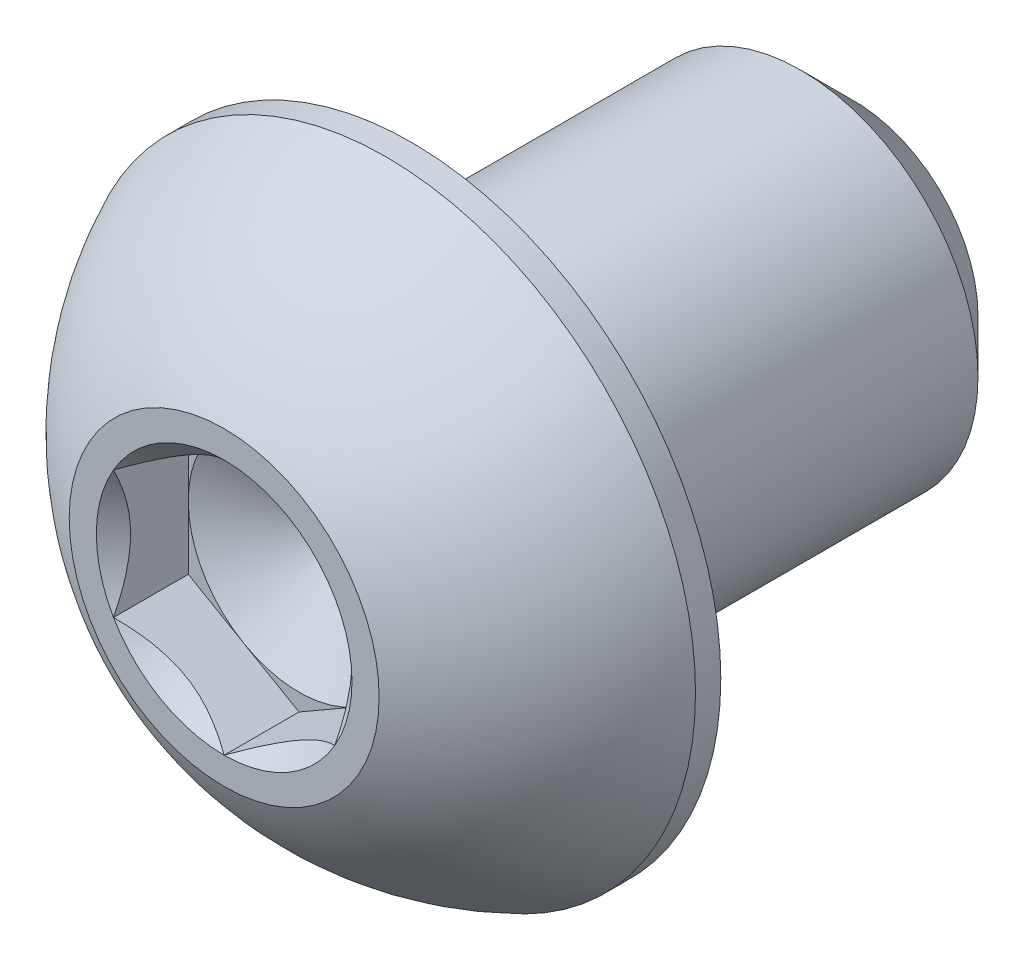
ISO-10303-21;
HEADER;
FILE_DESCRIPTION(('STEP AP214'),'2;1');
FILE_NAME('part.step','',(''),(''),'','','');
FILE_SCHEMA(('AUTOMOTIVE_DESIGN { 1 0 10303 214 1 1 1 1 }'));
ENDSEC;
DATA;
#1=APPLICATION_CONTEXT('core data for automotive mechanical design processes');
#2=APPLICATION_PROTOCOL_DEFINITION('international standard','automotive_design',2000,#1);
#3=PRODUCT_CONTEXT('',#1,'mechanical');
#4=PRODUCT('Part','Part','',(#3));
#5=PRODUCT_RELATED_PRODUCT_CATEGORY('part','',(#4));
#6=PRODUCT_DEFINITION_FORMATION('','',#4);
#7=PRODUCT_DEFINITION_CONTEXT('part definition',#1,'design');
#8=PRODUCT_DEFINITION('design','',#6,#7);
#9=PRODUCT_DEFINITION_SHAPE('','',#8);
#10=(LENGTH_UNIT() NAMED_UNIT(*) SI_UNIT(.MILLI.,.METRE.));
#11=(NAMED_UNIT(*) PLANE_ANGLE_UNIT() SI_UNIT($,.RADIAN.));
#12=(NAMED_UNIT(*) SI_UNIT($,.STERADIAN.) SOLID_ANGLE_UNIT());
#13=UNCERTAINTY_MEASURE_WITH_UNIT(LENGTH_MEASURE(1.E-05),#10,'distance_accuracy_value','');
#14=(GEOMETRIC_REPRESENTATION_CONTEXT(3) GLOBAL_UNCERTAINTY_ASSIGNED_CONTEXT((#13)) GLOBAL_UNIT_ASSIGNED_CONTEXT((#10,
#11,#12)) REPRESENTATION_CONTEXT('',''));
#15=CARTESIAN_POINT('',(0.,0.,0.));
#16=DIRECTION('',(0.,0.,1.));
#17=DIRECTION('',(1.,0.,0.));
#18=AXIS2_PLACEMENT_3D('',#15,#16,#17);
#19=CARTESIAN_POINT('',(0.,1.984375,5.64515));
#20=DIRECTION('',(0.,0.,-1.));
#21=DIRECTION('',(-1.,0.,0.));
#22=AXIS2_PLACEMENT_3D('',#19,#20,#21);
#23=PLANE('',#22);
#24=CARTESIAN_POINT('',(0.,0.,5.64515));
#25=DIRECTION('',(0.,0.,1.));
#26=DIRECTION('',(1.,0.,0.));
#27=AXIS2_PLACEMENT_3D('',#24,#25,#26);
#28=CIRCLE('',#27,2.778125);
#29=CARTESIAN_POINT('',(0.,2.778125,5.64515));
#30=VERTEX_POINT('',#29);
#31=EDGE_CURVE('E187',#30,#30,#28,.T.);
#32=ORIENTED_EDGE('',*,*,#31,.T.);
#33=EDGE_LOOP('',(#32));
#34=FACE_BOUND('',#33,.T.);
#35=CARTESIAN_POINT('',(0.,0.,5.64515));
#36=DIRECTION('',(0.,0.,1.));
#37=DIRECTION('',(1.,0.,0.));
#38=AXIS2_PLACEMENT_3D('',#35,#36,#37);
#39=CIRCLE('',#38,2.29135888084633);
#40=CARTESIAN_POINT('',(0.,2.29135888084633,5.64515));
#41=VERTEX_POINT('',#40);
#42=CARTESIAN_POINT('',(-1.984375,1.14567944042316,5.64515));
#43=VERTEX_POINT('',#42);
#44=EDGE_CURVE('E129',#41,#43,#39,.T.);
#45=ORIENTED_EDGE('',*,*,#44,.F.);
#46=CARTESIAN_POINT('',(0.,0.,5.64515));
#47=DIRECTION('',(0.,0.,1.));
#48=DIRECTION('',(1.,0.,0.));
#49=AXIS2_PLACEMENT_3D('',#46,#47,#48);
#50=CIRCLE('',#49,2.29135888084633);
#51=CARTESIAN_POINT('',(1.984375,1.14567944042316,5.64515));
#52=VERTEX_POINT('',#51);
#53=EDGE_CURVE('E113',#52,#41,#50,.T.);
#54=ORIENTED_EDGE('',*,*,#53,.F.);
#55=CARTESIAN_POINT('',(0.,0.,5.64515));
#56=DIRECTION('',(0.,0.,1.));
#57=DIRECTION('',(1.,0.,0.));
#58=AXIS2_PLACEMENT_3D('',#55,#56,#57);
#59=CIRCLE('',#58,2.29135888084633);
#60=CARTESIAN_POINT('',(1.984375,-1.14567944042316,5.64515));
#61=VERTEX_POINT('',#60);
#62=EDGE_CURVE('E125',#61,#52,#59,.T.);
#63=ORIENTED_EDGE('',*,*,#62,.F.);
#64=CARTESIAN_POINT('',(0.,0.,5.64515));
#65=DIRECTION('',(0.,0.,1.));
#66=DIRECTION('',(1.,0.,0.));
#67=AXIS2_PLACEMENT_3D('',#64,#65,#66);
#68=CIRCLE('',#67,2.29135888084633);
#69=CARTESIAN_POINT('',(0.,-2.29135888084633,5.64515));
#70=VERTEX_POINT('',#69);
#71=EDGE_CURVE('E149',#70,#61,#68,.T.);
#72=ORIENTED_EDGE('',*,*,#71,.F.);
#73=CARTESIAN_POINT('',(0.,0.,5.64515));
#74=DIRECTION('',(0.,0.,1.));
#75=DIRECTION('',(1.,0.,0.));
#76=AXIS2_PLACEMENT_3D('',#73,#74,#75);
#77=CIRCLE('',#76,2.29135888084633);
#78=CARTESIAN_POINT('',(-1.984375,-1.14567944042317,5.64515));
#79=VERTEX_POINT('',#78);
#80=EDGE_CURVE('E463',#79,#70,#77,.T.);
#81=ORIENTED_EDGE('',*,*,#80,.F.);
#82=CARTESIAN_POINT('',(0.,0.,5.64515));
#83=DIRECTION('',(0.,0.,1.));
#84=DIRECTION('',(1.,0.,0.));
#85=AXIS2_PLACEMENT_3D('',#82,#83,#84);
#86=CIRCLE('',#85,2.29135888084633);
#87=EDGE_CURVE('E474',#43,#79,#86,.T.);
#88=ORIENTED_EDGE('',*,*,#87,.F.);
#89=EDGE_LOOP('',(#45,#54,#63,#72,#81,#88));
#90=FACE_BOUND('',#89,.T.);
#91=ADVANCED_FACE('F39',(#34,#90),#23,.F.);
#92=CARTESIAN_POINT('',(0.,0.,-5.64515));
#93=DIRECTION('',(0.,0.,1.));
#94=DIRECTION('',(1.,0.,0.));
#95=AXIS2_PLACEMENT_3D('',#92,#93,#94);
#96=CONICAL_SURFACE('',#95,2.2225,0.785398163397448);
#97=CARTESIAN_POINT('',(0.,0.,-4.69265));
#98=DIRECTION('',(0.,0.,1.));
#99=DIRECTION('',(1.,0.,0.));
#100=AXIS2_PLACEMENT_3D('',#97,#98,#99);
#101=CIRCLE('',#100,3.175);
#102=CARTESIAN_POINT('',(3.175,0.,-4.69265));
#103=VERTEX_POINT('',#102);
#104=EDGE_CURVE('E11',#103,#103,#101,.T.);
#105=ORIENTED_EDGE('',*,*,#104,.F.);
#106=EDGE_LOOP('',(#105));
#107=FACE_BOUND('',#106,.T.);
#108=CARTESIAN_POINT('',(0.,0.,-5.64515));
#109=DIRECTION('',(0.,0.,1.));
#110=DIRECTION('',(1.,0.,0.));
#111=AXIS2_PLACEMENT_3D('',#108,#109,#110);
#112=CIRCLE('',#111,2.2225);
#113=CARTESIAN_POINT('',(2.2225,0.,-5.64515));
#114=VERTEX_POINT('',#113);
#115=EDGE_CURVE('E178',#114,#114,#112,.T.);
#116=ORIENTED_EDGE('',*,*,#115,.T.);
#117=EDGE_LOOP('',(#116));
#118=FACE_BOUND('',#117,.T.);
#119=ADVANCED_FACE('F41',(#107,#118),#96,.T.);
#120=CARTESIAN_POINT('',(0.,0.,5.64515));
#121=DIRECTION('',(0.,0.,1.));
#122=DIRECTION('',(1.,0.,0.));
#123=AXIS2_PLACEMENT_3D('',#120,#121,#122);
#124=CYLINDRICAL_SURFACE('',#123,3.175);
#125=CARTESIAN_POINT('',(0.,0.,2.29235));
#126=DIRECTION('',(0.,0.,1.));
#127=DIRECTION('',(1.,0.,0.));
#128=AXIS2_PLACEMENT_3D('',#125,#126,#127);
#129=CIRCLE('',#128,3.175);
#130=CARTESIAN_POINT('',(3.175,0.,2.29235));
#131=VERTEX_POINT('',#130);
#132=EDGE_CURVE('E48',#131,#131,#129,.T.);
#133=ORIENTED_EDGE('',*,*,#132,.F.);
#134=EDGE_LOOP('',(#133));
#135=FACE_BOUND('',#134,.T.);
#136=ORIENTED_EDGE('',*,*,#104,.T.);
#137=EDGE_LOOP('',(#136));
#138=FACE_BOUND('',#137,.T.);
#139=ADVANCED_FACE('F205',(#135,#138),#124,.T.);
#140=CARTESIAN_POINT('',(0.,5.5499,2.29235));
#141=DIRECTION('',(0.,0.,1.));
#142=DIRECTION('',(1.,0.,0.));
#143=AXIS2_PLACEMENT_3D('',#140,#141,#142);
#144=PLANE('',#143);
#145=CARTESIAN_POINT('',(0.,0.,2.29235));
#146=DIRECTION('',(0.,0.,1.));
#147=DIRECTION('',(1.,0.,0.));
#148=AXIS2_PLACEMENT_3D('',#145,#146,#147);
#149=CIRCLE('',#148,5.5499);
#150=CARTESIAN_POINT('',(5.5499,0.,2.29235));
#151=VERTEX_POINT('',#150);
#152=EDGE_CURVE('E196',#151,#151,#149,.T.);
#153=ORIENTED_EDGE('',*,*,#152,.F.);
#154=EDGE_LOOP('',(#153));
#155=FACE_BOUND('',#154,.T.);
#156=ORIENTED_EDGE('',*,*,#132,.T.);
#157=EDGE_LOOP('',(#156));
#158=FACE_BOUND('',#157,.T.);
#159=ADVANCED_FACE('F203',(#155,#158),#144,.F.);
#160=CARTESIAN_POINT('',(0.,0.,5.64515));
#161=DIRECTION('',(0.,0.,1.));
#162=DIRECTION('',(1.,0.,0.));
#163=AXIS2_PLACEMENT_3D('',#160,#161,#162);
#164=CYLINDRICAL_SURFACE('',#163,5.5499);
#165=CARTESIAN_POINT('',(0.,0.,2.74592142857143));
#166=DIRECTION('',(0.,0.,1.));
#167=DIRECTION('',(1.,0.,0.));
#168=AXIS2_PLACEMENT_3D('',#165,#166,#167);
#169=CIRCLE('',#168,5.5499);
#170=CARTESIAN_POINT('',(0.,5.5499,2.74592142857143));
#171=VERTEX_POINT('',#170);
#172=EDGE_CURVE('E192',#171,#171,#169,.T.);
#173=ORIENTED_EDGE('',*,*,#172,.F.);
#174=EDGE_LOOP('',(#173));
#175=FACE_BOUND('',#174,.T.);
#176=ORIENTED_EDGE('',*,*,#152,.T.);
#177=EDGE_LOOP('',(#176));
#178=FACE_BOUND('',#177,.T.);
#179=ADVANCED_FACE('F224',(#175,#178),#164,.T.);
#180=CARTESIAN_POINT('',(0.,0.,0.214578206854551));
#181=DIRECTION('',(0.,0.,1.));
#182=DIRECTION('',(0.,1.,0.));
#183=AXIS2_PLACEMENT_3D('',#180,#181,#182);
#184=SPHERICAL_SURFACE('',#183,6.09992528775);
#185=CARTESIAN_POINT('',(0.,2.778125,5.64515));
#186=CARTESIAN_POINT('',(0.,2.81602671338563,5.62576064772217));
#187=CARTESIAN_POINT('',(0.,2.85372537445918,5.60597438218914));
#188=CARTESIAN_POINT('',(0.,2.92870021164798,5.5656169699155));
#189=CARTESIAN_POINT('',(0.,2.96597638776324,5.54504582317489));
#190=CARTESIAN_POINT('',(0.,3.04008987470138,5.5031275937889));
#191=CARTESIAN_POINT('',(0.,3.07692718552426,5.48178051114351));
#192=CARTESIAN_POINT('',(0.,3.15014680356086,5.43831978760222));
#193=CARTESIAN_POINT('',(0.,3.18652911077458,5.41620614670631));
#194=CARTESIAN_POINT('',(0.,3.25882276944387,5.37122199565968));
#195=CARTESIAN_POINT('',(0.,3.29473412089944,5.34835148550897));
#196=CARTESIAN_POINT('',(0.,3.36607012592493,5.30186362336544));
#197=CARTESIAN_POINT('',(0.,3.40149477949484,5.27824627137263));
#198=CARTESIAN_POINT('',(0.,3.47184185902622,5.23027507858578));
#199=CARTESIAN_POINT('',(0.,3.50676428498768,5.20592123779175));
#200=CARTESIAN_POINT('',(0.,3.57609160000261,5.15648774378183));
#201=CARTESIAN_POINT('',(0.,3.61049648905608,5.13140809056595));
#202=CARTESIAN_POINT('',(0.,3.67877364776563,5.08053396614726));
#203=CARTESIAN_POINT('',(0.,3.71264591742172,5.05473949494445));
#204=CARTESIAN_POINT('',(0.,3.77984298835613,5.00244704238412));
#205=CARTESIAN_POINT('',(0.,3.81316778963445,4.97594906102659));
#206=CARTESIAN_POINT('',(0.,3.87925531482814,4.92226120438586));
#207=CARTESIAN_POINT('',(0.,3.91201803874352,4.89507132910267));
#208=CARTESIAN_POINT('',(0.,3.97696704663191,4.84001160415579));
#209=CARTESIAN_POINT('',(0.,4.00915333060493,4.81214175449209));
#210=CARTESIAN_POINT('',(0.,4.07293534872958,4.75573429841707));
#211=CARTESIAN_POINT('',(0.,4.10453108288122,4.72719669200573));
#212=CARTESIAN_POINT('',(0.,4.16711815037044,4.66946623280082));
#213=CARTESIAN_POINT('',(0.,4.19810948370802,4.64027338000723));
#214=CARTESIAN_POINT('',(0.,4.25947416353471,4.58124522565121));
#215=CARTESIAN_POINT('',(0.,4.28984751002382,4.55140992408877));
#216=CARTESIAN_POINT('',(0.,4.34996290103328,4.49110995144623));
#217=CARTESIAN_POINT('',(0.,4.37970494555363,4.46064528036614));
#218=CARTESIAN_POINT('',(0.,4.43854469425657,4.39909992384361));
#219=CARTESIAN_POINT('',(0.,4.46764239843916,4.36801923840117));
#220=CARTESIAN_POINT('',(0.,4.52518071056457,4.30525547835869));
#221=CARTESIAN_POINT('',(0.,4.55362131850739,4.27357240375866));
#222=CARTESIAN_POINT('',(0.,4.60983297031029,4.20961775468214));
#223=CARTESIAN_POINT('',(0.,4.63760401417035,4.17734618020565));
#224=CARTESIAN_POINT('',(0.,4.6924643634894,4.11222867864499));
#225=CARTESIAN_POINT('',(0.,4.71955366894838,4.07938275156081));
#226=CARTESIAN_POINT('',(0.,4.77303866600855,4.01313094383918));
#227=CARTESIAN_POINT('',(0.,4.79943435760973,3.97972506320173));
#228=CARTESIAN_POINT('',(0.,4.85152055556542,3.91236799290146));
#229=CARTESIAN_POINT('',(0.,4.87721106191991,3.87841680323865));
#230=CARTESIAN_POINT('',(0.,4.927875627133,3.80998399846878));
#231=CARTESIAN_POINT('',(0.,4.95284968599158,3.77550238336172));
#232=CARTESIAN_POINT('',(0.,5.00207040804361,3.70602384381449));
#233=CARTESIAN_POINT('',(0.,5.02631707123706,3.67102691937433));
#234=CARTESIAN_POINT('',(0.,5.0740723726572,3.60053310316971));
#235=CARTESIAN_POINT('',(0.,5.09758101088389,3.56503621140527));
#236=CARTESIAN_POINT('',(0.,5.1438499566405,3.4935580217543));
#237=CARTESIAN_POINT('',(0.,5.16661026417041,3.45757672386778));
#238=CARTESIAN_POINT('',(0.,5.21137257072763,3.38514549546688));
#239=CARTESIAN_POINT('',(0.,5.23337456975495,3.3486955649525));
#240=CARTESIAN_POINT('',(0.,5.276610614416,3.27534305046432));
#241=CARTESIAN_POINT('',(0.,5.29784466004975,3.23844046649051));
#242=CARTESIAN_POINT('',(0.,5.33953548787471,3.16419882181283));
#243=CARTESIAN_POINT('',(0.,5.35999227006592,3.12685976110895));
#244=CARTESIAN_POINT('',(0.,5.40011960846765,3.05176153430598));
#245=CARTESIAN_POINT('',(0.,5.41979016467818,3.01400236820689));
#246=CARTESIAN_POINT('',(0.,5.45833640797136,2.93808047394067));
#247=CARTESIAN_POINT('',(0.,5.47721209505402,2.89991774577356));
#248=CARTESIAN_POINT('',(0.,5.51416039973219,2.82320549304741));
#249=CARTESIAN_POINT('',(0.,5.53223301732771,2.78465596848837));
#250=CARTESIAN_POINT('',(0.,5.5499,2.74592142857143));
#251=B_SPLINE_CURVE_WITH_KNOTS('',3,(#185,#186,#187,#188,#189,#190,#191,#192,#193,#194,#195,
#196,#197,#198,#199,#200,#201,#202,#203,#204,#205,#206,#207,#208,#209,#210,#211,#212,#213,#214,
#215,#216,#217,#218,#219,#220,#221,#222,#223,#224,#225,#226,#227,#228,#229,#230,#231,#232,#233,
#234,#235,#236,#237,#238,#239,#240,#241,#242,#243,#244,#245,#246,#247,#248,#249,#250),
.UNSPECIFIED.,.F.,.F.,(4,2,2,2,2,2,2,2,2,2,2,2,2,2,2,2,2,2,2,2,2,2,2,2,2,2,2,2,2,2,2,2,4),(0.,
0.127717597491554,0.255435194983109,0.383152792474662,0.510870389966216,0.63858798745777,
0.766305584949325,0.894023182440878,1.02174077993243,1.14945837742399,1.27717597491554,
1.4048935724071,1.53261116989865,1.6603287673902,1.78804636488176,1.91576396237331,
2.04348155986487,2.17119915735642,2.29891675484797,2.42663435233953,2.55435194983108,
2.68206954732264,2.80978714481419,2.93750474230574,3.0652223397973,3.19293993728885,
3.32065753478041,3.44837513227196,3.57609272976351,3.70381032725507,3.83152792474662,
3.95924552223818,4.08696311972973),.UNSPECIFIED.);
#252=EDGE_CURVE('BSEAM216',#30,#171,#251,.T.);
#253=ORIENTED_EDGE('',*,*,#31,.F.);
#254=ORIENTED_EDGE('',*,*,#172,.T.);
#255=ORIENTED_EDGE('',*,*,#252,.T.);
#256=ORIENTED_EDGE('',*,*,#252,.F.);
#257=EDGE_LOOP('',(#253,#255,#254,#256));
#258=FACE_BOUND('',#257,.T.);
#259=ADVANCED_FACE('F216',(#258),#184,.T.);
#260=CARTESIAN_POINT('',(0.,2.2225,-5.64515));
#261=DIRECTION('',(0.,0.,1.));
#262=DIRECTION('',(1.,0.,0.));
#263=AXIS2_PLACEMENT_3D('',#260,#261,#262);
#264=PLANE('',#263);
#265=ORIENTED_EDGE('',*,*,#115,.F.);
#266=EDGE_LOOP('',(#265));
#267=FACE_BOUND('',#266,.T.);
#268=ADVANCED_FACE('F214',(#267),#264,.F.);
#269=CARTESIAN_POINT('',(1.984375,1.14567944042316,5.64515));
#270=DIRECTION('',(-0.499999999999999,-0.866025403784439,0.));
#271=DIRECTION('',(0.866025403784439,-0.499999999999999,0.));
#272=AXIS2_PLACEMENT_3D('',#269,#270,#271);
#273=PLANE('',#272);
#274=CARTESIAN_POINT('',(1.984575,1.14556397036933,5.64526547878184));
#275=CARTESIAN_POINT('',(1.9163590048332,1.18494849354192,5.60591285226392));
#276=CARTESIAN_POINT('',(1.84700231489304,1.22499159714897,5.56887131044619));
#277=CARTESIAN_POINT('',(1.70557619954781,1.30664400291398,5.50104885842332));
#278=CARTESIAN_POINT('',(1.63349332126322,1.34826107209555,5.47030568909175));
#279=CARTESIAN_POINT('',(1.488141602734,1.43217992591557,5.41764188881121));
#280=CARTESIAN_POINT('',(1.41490978751306,1.47446033414663,5.39558887587996));
#281=CARTESIAN_POINT('',(1.26683381740529,1.55995203534886,5.36161149294388));
#282=CARTESIAN_POINT('',(1.19199418724657,1.60316071596705,5.34966175609173));
#283=CARTESIAN_POINT('',(1.06301458545618,1.6776271237807,5.33888009908191));
#284=CARTESIAN_POINT('',(1.00904128422756,1.7087886237741,5.33728389905907));
#285=CARTESIAN_POINT('',(0.901182881480197,1.77106070163465,5.33997183886529));
#286=CARTESIAN_POINT('',(0.847297817514474,1.80217125782056,5.34425804034046));
#287=CARTESIAN_POINT('',(0.740036461751394,1.86409863044402,5.35846687301352));
#288=CARTESIAN_POINT('',(0.686660807239857,1.89491507894443,5.36839581045227));
#289=CARTESIAN_POINT('',(0.580832482591101,1.95601509066828,5.39334508427454));
#290=CARTESIAN_POINT('',(0.528379742028896,1.9862986945516,5.40836503038949));
#291=CARTESIAN_POINT('',(0.394017661036349,2.06387267818152,5.45295785163567));
#292=CARTESIAN_POINT('',(0.312941642841674,2.11068193911104,5.48589299593833));
#293=CARTESIAN_POINT('',(0.193726693270159,2.17951072233758,5.5414924412022));
#294=CARTESIAN_POINT('',(0.154440075613997,2.20219286161692,5.56102759205186));
#295=CARTESIAN_POINT('',(0.0765946381319456,2.24713694590237,5.6018787381194));
#296=CARTESIAN_POINT('',(0.0380353888982999,2.26939913882716,5.62319363956835));
#297=CARTESIAN_POINT('',(-0.000200000000001239,2.29147435090016,5.64526547878184));
#298=B_SPLINE_CURVE_WITH_KNOTS('',3,(#274,#275,#276,#277,#278,#279,#280,#281,#282,#283,#284,
#285,#286,#287,#288,#289,#290,#291,#292,#293,#294,#295,#296,#297),.UNSPECIFIED.,.F.,.F.,(4,2,2,
2,2,2,2,2,2,2,2,4),(0.,0.264339630306627,0.530219665093695,0.791876416371462,1.05287424418109,
1.239639843932,1.42647091743853,1.61351120244035,1.80053715247541,2.09764209964316,
2.24579179873714,2.39385111134157),.UNSPECIFIED.);
#299=EDGE_CURVE('E110',#52,#41,#298,.T.);
#300=ORIENTED_EDGE('',*,*,#299,.T.);
#301=DIRECTION('',(0.,0.,-1.));
#302=VECTOR('',#301,1.);
#303=CARTESIAN_POINT('',(0.,2.29135888084633,5.64515));
#304=LINE('',#303,#302);
#305=CARTESIAN_POINT('',(0.,2.29135888084633,4.30403));
#306=VERTEX_POINT('',#305);
#307=EDGE_CURVE('E175',#41,#306,#304,.T.);
#308=ORIENTED_EDGE('',*,*,#307,.T.);
#309=DIRECTION('',(-0.866025403784439,0.499999999999999,0.));
#310=VECTOR('',#309,1.);
#311=CARTESIAN_POINT('',(1.984375,1.14567944042316,4.30403));
#312=LINE('',#311,#310);
#313=CARTESIAN_POINT('',(0.992187499999998,1.71851916063475,4.30403));
#314=VERTEX_POINT('',#313);
#315=EDGE_CURVE('E505',#314,#306,#312,.T.);
#316=ORIENTED_EDGE('',*,*,#315,.F.);
#317=CARTESIAN_POINT('',(1.984375,1.14567944042316,4.30403));
#318=VERTEX_POINT('',#317);
#319=EDGE_CURVE('E55',#318,#314,#312,.T.);
#320=ORIENTED_EDGE('',*,*,#319,.F.);
#321=DIRECTION('',(0.,0.,-1.));
#322=VECTOR('',#321,1.);
#323=CARTESIAN_POINT('',(1.984375,1.14567944042316,5.64515));
#324=LINE('',#323,#322);
#325=EDGE_CURVE('E144',#52,#318,#324,.T.);
#326=ORIENTED_EDGE('',*,*,#325,.F.);
#327=EDGE_LOOP('',(#300,#308,#316,#320,#326));
#328=FACE_BOUND('',#327,.T.);
#329=ADVANCED_FACE('F151',(#328),#273,.T.);
#330=CARTESIAN_POINT('',(0.,2.29135888084633,5.64515));
#331=DIRECTION('',(0.5,-0.866025403784438,0.));
#332=DIRECTION('',(0.866025403784438,0.5,0.));
#333=AXIS2_PLACEMENT_3D('',#330,#331,#332);
#334=PLANE('',#333);
#335=CARTESIAN_POINT('',(0.000199999999998713,2.29147435090016,5.64526547878184));
#336=CARTESIAN_POINT('',(-0.0680159951668038,2.25208982772757,5.60591285226391));
#337=CARTESIAN_POINT('',(-0.137372685106967,2.21204672412052,5.56887131044618));
#338=CARTESIAN_POINT('',(-0.278798800452189,2.13039431835551,5.50104885842332));
#339=CARTESIAN_POINT('',(-0.350881678736784,2.08877724917394,5.47030568909175));
#340=CARTESIAN_POINT('',(-0.496233397266005,2.00485839535392,5.41764188881121));
#341=CARTESIAN_POINT('',(-0.56946521248694,1.96257798712286,5.39558887587996));
#342=CARTESIAN_POINT('',(-0.717541182594707,1.87708628592063,5.36161149294388));
#343=CARTESIAN_POINT('',(-0.792380812753426,1.83387760530244,5.34966175609173));
#344=CARTESIAN_POINT('',(-0.921360414543817,1.75941119748879,5.33888009908191));
#345=CARTESIAN_POINT('',(-0.975333715772444,1.72824969749539,5.33728389905907));
#346=CARTESIAN_POINT('',(-1.0831921185198,1.66597761963484,5.33997183886529));
#347=CARTESIAN_POINT('',(-1.13707718248553,1.63486706344893,5.34425804034046));
#348=CARTESIAN_POINT('',(-1.24433853824861,1.57293969082547,5.35846687301352));
#349=CARTESIAN_POINT('',(-1.29771419276014,1.54212324232506,5.36839581045227));
#350=CARTESIAN_POINT('',(-1.4035425174089,1.48102323060121,5.39334508427454));
#351=CARTESIAN_POINT('',(-1.4559952579711,1.45073962671789,5.40836503038949));
#352=CARTESIAN_POINT('',(-1.59035733896365,1.37316564308797,5.45295785163567));
#353=CARTESIAN_POINT('',(-1.67143335715833,1.32635638215845,5.48589299593833));
#354=CARTESIAN_POINT('',(-1.79064830672984,1.25752759893191,5.5414924412022));
#355=CARTESIAN_POINT('',(-1.829934924386,1.23484545965257,5.56102759205186));
#356=CARTESIAN_POINT('',(-1.90778036186805,1.18990137536712,5.6018787381194));
#357=CARTESIAN_POINT('',(-1.9463396111017,1.16763918244233,5.62319363956835));
#358=CARTESIAN_POINT('',(-1.984575,1.14556397036933,5.64526547878184));
#359=B_SPLINE_CURVE_WITH_KNOTS('',3,(#335,#336,#337,#338,#339,#340,#341,#342,#343,#344,#345,
#346,#347,#348,#349,#350,#351,#352,#353,#354,#355,#356,#357,#358),.UNSPECIFIED.,.F.,.F.,(4,2,2,
2,2,2,2,2,2,2,2,4),(0.,0.264339630306627,0.530219665093694,0.79187641637146,1.05287424418109,
1.239639843932,1.42647091743852,1.61351120244035,1.8005371524754,2.09764209964316,
2.24579179873714,2.39385111134157),.UNSPECIFIED.);
#360=EDGE_CURVE('E490',#41,#43,#359,.T.);
#361=ORIENTED_EDGE('',*,*,#360,.T.);
#362=DIRECTION('',(0.,0.,-1.));
#363=VECTOR('',#362,1.);
#364=CARTESIAN_POINT('',(-1.984375,1.14567944042316,5.64515));
#365=LINE('',#364,#363);
#366=CARTESIAN_POINT('',(-1.984375,1.14567944042316,4.30403));
#367=VERTEX_POINT('',#366);
#368=EDGE_CURVE('E171',#43,#367,#365,.T.);
#369=ORIENTED_EDGE('',*,*,#368,.T.);
#370=DIRECTION('',(-0.866025403784438,-0.5,0.));
#371=VECTOR('',#370,1.);
#372=CARTESIAN_POINT('',(0.,2.29135888084633,4.30403));
#373=LINE('',#372,#371);
#374=CARTESIAN_POINT('',(-0.9921875,1.71851916063474,4.30403));
#375=VERTEX_POINT('',#374);
#376=EDGE_CURVE('E508',#375,#367,#373,.T.);
#377=ORIENTED_EDGE('',*,*,#376,.F.);
#378=EDGE_CURVE('E509',#306,#375,#373,.T.);
#379=ORIENTED_EDGE('',*,*,#378,.F.);
#380=ORIENTED_EDGE('',*,*,#307,.F.);
#381=EDGE_LOOP('',(#361,#369,#377,#379,#380));
#382=FACE_BOUND('',#381,.T.);
#383=ADVANCED_FACE('F222',(#382),#334,.T.);
#384=CARTESIAN_POINT('',(-1.984375,1.14567944042316,5.64515));
#385=DIRECTION('',(1.,0.,0.));
#386=DIRECTION('',(0.,0.,-1.));
#387=AXIS2_PLACEMENT_3D('',#384,#385,#386);
#388=PLANE('',#387);
#389=CARTESIAN_POINT('',(-1.984375,-2.24664989492636,6.35132008331692));
#390=CARTESIAN_POINT('',(-1.984375,-2.19177035879913,6.31019669928858));
#391=CARTESIAN_POINT('',(-1.984375,-2.1365793309425,6.2694829661326));
#392=CARTESIAN_POINT('',(-1.984375,-2.0254530694156,6.18905486706175));
#393=CARTESIAN_POINT('',(-1.984375,-1.96951764844329,6.1493407602265));
#394=CARTESIAN_POINT('',(-1.984375,-1.85637247000972,6.07080999604987));
#395=CARTESIAN_POINT('',(-1.984375,-1.79915619451492,6.03200268502025));
#396=CARTESIAN_POINT('',(-1.984375,-1.68374612486123,5.95588116655778));
#397=CARTESIAN_POINT('',(-1.984375,-1.62555240093273,5.91856685249807));
#398=CARTESIAN_POINT('',(-1.984375,-1.44283684202776,5.80531794235897));
#399=CARTESIAN_POINT('',(-1.984375,-1.31636516124235,5.73247141910061));
#400=CARTESIAN_POINT('',(-1.984375,-1.05716498260296,5.59946175577765));
#401=CARTESIAN_POINT('',(-1.984375,-0.924459462264122,5.53925591965465));
#402=CARTESIAN_POINT('',(-1.984375,-0.724893074141588,5.46561183961541));
#403=CARTESIAN_POINT('',(-1.984375,-0.660907572248813,5.44441291748557));
#404=CARTESIAN_POINT('',(-1.984375,-0.531425551080247,5.40715711479737));
#405=CARTESIAN_POINT('',(-1.984375,-0.465928924835295,5.39110059946328));
#406=CARTESIAN_POINT('',(-1.984375,-0.334891945890405,5.36522084345925));
#407=CARTESIAN_POINT('',(-1.984375,-0.269372555502921,5.35529310154836));
#408=CARTESIAN_POINT('',(-1.984375,-0.137675185771461,5.34185859031056));
#409=CARTESIAN_POINT('',(-1.984375,-0.071497313578063,5.33835079294676));
#410=CARTESIAN_POINT('',(-1.984375,0.0586431546448481,5.33800164823735));
#411=CARTESIAN_POINT('',(-1.984375,0.122605247687118,5.34093962459112));
#412=CARTESIAN_POINT('',(-1.984375,0.249962419599664,5.35284170918258));
#413=CARTESIAN_POINT('',(-1.984375,0.313357441624571,5.36180641485243));
#414=CARTESIAN_POINT('',(-1.984375,0.440194078343455,5.38543115034761));
#415=CARTESIAN_POINT('',(-1.984375,0.503617615772964,5.40018679973638));
#416=CARTESIAN_POINT('',(-1.984375,0.629083701047629,5.4346207574727));
#417=CARTESIAN_POINT('',(-1.984375,0.691126376772748,5.45429860789798));
#418=CARTESIAN_POINT('',(-1.984375,0.888252191671363,5.52417518633261));
#419=CARTESIAN_POINT('',(-1.984375,1.02048040542615,5.58240558934036));
#420=CARTESIAN_POINT('',(-1.984375,1.27871806100267,5.71181918027673));
#421=CARTESIAN_POINT('',(-1.984375,1.40470281207756,5.78304927195745));
#422=CARTESIAN_POINT('',(-1.984375,1.5867785992022,5.89416293194116));
#423=CARTESIAN_POINT('',(-1.984375,1.64484387516129,5.93087382489262));
#424=CARTESIAN_POINT('',(-1.984375,1.75997827817988,6.00583744763746));
#425=CARTESIAN_POINT('',(-1.984375,1.81704732901584,6.04409029467485));
#426=CARTESIAN_POINT('',(-1.984375,1.92985499213404,6.12153678199377));
#427=CARTESIAN_POINT('',(-1.984375,1.98560066211377,6.16072019322867));
#428=CARTESIAN_POINT('',(-1.984375,2.09633159947627,6.24011660992608));
#429=CARTESIAN_POINT('',(-1.984375,2.15131707145809,6.2803293297131));
#430=CARTESIAN_POINT('',(-1.984375,2.20598450458982,6.32096347260997));
#431=B_SPLINE_CURVE_WITH_KNOTS('',3,(#389,#390,#391,#392,#393,#394,#395,#396,#397,#398,#399,
#400,#401,#402,#403,#404,#405,#406,#407,#408,#409,#410,#411,#412,#413,#414,#415,#416,#417,#418,
#419,#420,#421,#422,#423,#424,#425,#426,#427,#428,#429,#430),.UNSPECIFIED.,.F.,.F.,(4,2,2,2,2,2,
2,2,2,2,2,2,2,2,2,2,2,2,2,2,4),(0.,0.205736210356766,0.411525204809809,0.618909845914796,
0.826279649489809,1.26374370453551,1.69970549535382,1.90175047418286,2.10380979948048,
2.3023211047986,2.50080061937433,2.69259135253523,2.88440110079442,3.07952109080018,
3.27462293514803,3.70679897011889,4.14056631296021,4.34663769336143,4.55272477227101,
4.7571295110882,4.96147812147718),.UNSPECIFIED.);
#432=EDGE_CURVE('E482',#43,#79,#431,.F.);
#433=ORIENTED_EDGE('',*,*,#432,.T.);
#434=DIRECTION('',(0.,0.,-1.));
#435=VECTOR('',#434,1.);
#436=CARTESIAN_POINT('',(-1.984375,-1.14567944042316,5.64515));
#437=LINE('',#436,#435);
#438=CARTESIAN_POINT('',(-1.984375,-1.14567944042316,4.30403));
#439=VERTEX_POINT('',#438);
#440=EDGE_CURVE('E167',#79,#439,#437,.T.);
#441=ORIENTED_EDGE('',*,*,#440,.T.);
#442=DIRECTION('',(0.,-1.,0.));
#443=VECTOR('',#442,1.);
#444=CARTESIAN_POINT('',(-1.984375,1.14567944042316,4.30403));
#445=LINE('',#444,#443);
#446=CARTESIAN_POINT('',(-1.984375,0.,4.30403));
#447=VERTEX_POINT('',#446);
#448=EDGE_CURVE('E513',#447,#439,#445,.T.);
#449=ORIENTED_EDGE('',*,*,#448,.F.);
#450=EDGE_CURVE('E514',#367,#447,#445,.T.);
#451=ORIENTED_EDGE('',*,*,#450,.F.);
#452=ORIENTED_EDGE('',*,*,#368,.F.);
#453=EDGE_LOOP('',(#433,#441,#449,#451,#452));
#454=FACE_BOUND('',#453,.T.);
#455=ADVANCED_FACE('F343',(#454),#388,.T.);
#456=CARTESIAN_POINT('',(-1.984375,-1.14567944042316,5.64515));
#457=DIRECTION('',(0.499999999999999,0.866025403784439,0.));
#458=DIRECTION('',(-0.866025403784439,0.5,0.));
#459=AXIS2_PLACEMENT_3D('',#456,#457,#458);
#460=PLANE('',#459);
#461=CARTESIAN_POINT('',(-1.984575,-1.14556397036933,5.64526547878184));
#462=CARTESIAN_POINT('',(-1.9163590048332,-1.18494849354192,5.60591285226392));
#463=CARTESIAN_POINT('',(-1.84700231489303,-1.22499159714897,5.56887131044618));
#464=CARTESIAN_POINT('',(-1.70557619954781,-1.30664400291398,5.50104885842332));
#465=CARTESIAN_POINT('',(-1.63349332126322,-1.34826107209555,5.47030568909175));
#466=CARTESIAN_POINT('',(-1.488141602734,-1.43217992591557,5.41764188881121));
#467=CARTESIAN_POINT('',(-1.41490978751306,-1.47446033414663,5.39558887587997));
#468=CARTESIAN_POINT('',(-1.26683381740529,-1.55995203534886,5.36161149294388));
#469=CARTESIAN_POINT('',(-1.19199418724657,-1.60316071596705,5.34966175609173));
#470=CARTESIAN_POINT('',(-1.06301458545618,-1.6776271237807,5.33888009908191));
#471=CARTESIAN_POINT('',(-1.00904128422756,-1.7087886237741,5.33728389905907));
#472=CARTESIAN_POINT('',(-0.901182881480199,-1.77106070163465,5.33997183886529));
#473=CARTESIAN_POINT('',(-0.847297817514476,-1.80217125782056,5.34425804034046));
#474=CARTESIAN_POINT('',(-0.740036461751395,-1.86409863044402,5.35846687301352));
#475=CARTESIAN_POINT('',(-0.686660807239858,-1.89491507894443,5.36839581045227));
#476=CARTESIAN_POINT('',(-0.580832482591102,-1.95601509066828,5.39334508427454));
#477=CARTESIAN_POINT('',(-0.528379742028897,-1.9862986945516,5.40836503038949));
#478=CARTESIAN_POINT('',(-0.39401766103635,-2.06387267818152,5.45295785163567));
#479=CARTESIAN_POINT('',(-0.312941642841674,-2.11068193911104,5.48589299593833));
#480=CARTESIAN_POINT('',(-0.193726693270159,-2.17951072233758,5.5414924412022));
#481=CARTESIAN_POINT('',(-0.154440075613997,-2.20219286161692,5.56102759205186));
#482=CARTESIAN_POINT('',(-0.0765946381319455,-2.24713694590237,5.6018787381194));
#483=CARTESIAN_POINT('',(-0.0380353888982997,-2.26939913882716,5.62319363956835));
#484=CARTESIAN_POINT('',(0.000200000000001901,-2.29147435090017,5.64526547878184));
#485=B_SPLINE_CURVE_WITH_KNOTS('',3,(#461,#462,#463,#464,#465,#466,#467,#468,#469,#470,#471,
#472,#473,#474,#475,#476,#477,#478,#479,#480,#481,#482,#483,#484),.UNSPECIFIED.,.F.,.F.,(4,2,2,
2,2,2,2,2,2,2,2,4),(0.,0.264339630306627,0.530219665093695,0.791876416371461,1.05287424418109,
1.239639843932,1.42647091743852,1.61351120244035,1.8005371524754,2.09764209964316,
2.24579179873714,2.39385111134157),.UNSPECIFIED.);
#486=EDGE_CURVE('E466',#79,#70,#485,.T.);
#487=ORIENTED_EDGE('',*,*,#486,.T.);
#488=DIRECTION('',(0.,0.,-1.));
#489=VECTOR('',#488,1.);
#490=CARTESIAN_POINT('',(0.,-2.29135888084633,5.64515));
#491=LINE('',#490,#489);
#492=CARTESIAN_POINT('',(0.,-2.29135888084633,4.30403));
#493=VERTEX_POINT('',#492);
#494=EDGE_CURVE('E157',#70,#493,#491,.T.);
#495=ORIENTED_EDGE('',*,*,#494,.T.);
#496=DIRECTION('',(0.866025403784439,-0.499999999999999,0.));
#497=VECTOR('',#496,1.);
#498=CARTESIAN_POINT('',(-1.984375,-1.14567944042316,4.30403));
#499=LINE('',#498,#497);
#500=CARTESIAN_POINT('',(-0.992187499999999,-1.71851916063475,4.30403));
#501=VERTEX_POINT('',#500);
#502=EDGE_CURVE('E518',#501,#493,#499,.T.);
#503=ORIENTED_EDGE('',*,*,#502,.F.);
#504=EDGE_CURVE('E519',#439,#501,#499,.T.);
#505=ORIENTED_EDGE('',*,*,#504,.F.);
#506=ORIENTED_EDGE('',*,*,#440,.F.);
#507=EDGE_LOOP('',(#487,#495,#503,#505,#506));
#508=FACE_BOUND('',#507,.T.);
#509=ADVANCED_FACE('F353',(#508),#460,.T.);
#510=CARTESIAN_POINT('',(0.,-2.29135888084633,5.64515));
#511=DIRECTION('',(-0.5,0.866025403784438,0.));
#512=DIRECTION('',(-0.866025403784439,-0.5,0.));
#513=AXIS2_PLACEMENT_3D('',#510,#511,#512);
#514=PLANE('',#513);
#515=CARTESIAN_POINT('',(-0.00019999999999806,-2.29147435090017,5.64526547878184));
#516=CARTESIAN_POINT('',(0.0680159951668044,-2.25208982772757,5.60591285226392));
#517=CARTESIAN_POINT('',(0.137372685106968,-2.21204672412052,5.56887131044619));
#518=CARTESIAN_POINT('',(0.278798800452189,-2.13039431835551,5.50104885842332));
#519=CARTESIAN_POINT('',(0.350881678736784,-2.08877724917394,5.47030568909175));
#520=CARTESIAN_POINT('',(0.496233397266005,-2.00485839535392,5.41764188881121));
#521=CARTESIAN_POINT('',(0.569465212486939,-1.96257798712287,5.39558887587997));
#522=CARTESIAN_POINT('',(0.717541182594707,-1.87708628592063,5.36161149294388));
#523=CARTESIAN_POINT('',(0.792380812753425,-1.83387760530244,5.34966175609173));
#524=CARTESIAN_POINT('',(0.921360414543816,-1.75941119748879,5.33888009908191));
#525=CARTESIAN_POINT('',(0.975333715772443,-1.72824969749539,5.33728389905907));
#526=CARTESIAN_POINT('',(1.0831921185198,-1.66597761963484,5.33997183886529));
#527=CARTESIAN_POINT('',(1.13707718248552,-1.63486706344893,5.34425804034046));
#528=CARTESIAN_POINT('',(1.2443385382486,-1.57293969082547,5.35846687301352));
#529=CARTESIAN_POINT('',(1.29771419276014,-1.54212324232506,5.36839581045227));
#530=CARTESIAN_POINT('',(1.4035425174089,-1.48102323060122,5.39334508427454));
#531=CARTESIAN_POINT('',(1.4559952579711,-1.45073962671789,5.40836503038949));
#532=CARTESIAN_POINT('',(1.59035733896365,-1.37316564308797,5.45295785163567));
#533=CARTESIAN_POINT('',(1.67143335715833,-1.32635638215845,5.48589299593833));
#534=CARTESIAN_POINT('',(1.79064830672984,-1.25752759893191,5.5414924412022));
#535=CARTESIAN_POINT('',(1.829934924386,-1.23484545965257,5.56102759205186));
#536=CARTESIAN_POINT('',(1.90778036186805,-1.18990137536713,5.6018787381194));
#537=CARTESIAN_POINT('',(1.9463396111017,-1.16763918244233,5.62319363956835));
#538=CARTESIAN_POINT('',(1.984575,-1.14556397036933,5.64526547878184));
#539=B_SPLINE_CURVE_WITH_KNOTS('',3,(#515,#516,#517,#518,#519,#520,#521,#522,#523,#524,#525,
#526,#527,#528,#529,#530,#531,#532,#533,#534,#535,#536,#537,#538),.UNSPECIFIED.,.F.,.F.,(4,2,2,
2,2,2,2,2,2,2,2,4),(0.,0.264339630306625,0.530219665093693,0.791876416371459,1.05287424418109,
1.239639843932,1.42647091743852,1.61351120244034,1.8005371524754,2.09764209964316,
2.24579179873714,2.39385111134157),.UNSPECIFIED.);
#540=EDGE_CURVE('E455',#70,#61,#539,.T.);
#541=ORIENTED_EDGE('',*,*,#540,.T.);
#542=DIRECTION('',(0.,0.,-1.));
#543=VECTOR('',#542,1.);
#544=CARTESIAN_POINT('',(1.984375,-1.14567944042316,5.64515));
#545=LINE('',#544,#543);
#546=CARTESIAN_POINT('',(1.984375,-1.14567944042316,4.30403));
#547=VERTEX_POINT('',#546);
#548=EDGE_CURVE('E147',#61,#547,#545,.T.);
#549=ORIENTED_EDGE('',*,*,#548,.T.);
#550=DIRECTION('',(0.866025403784438,0.5,0.));
#551=VECTOR('',#550,1.);
#552=CARTESIAN_POINT('',(0.,-2.29135888084633,4.30403));
#553=LINE('',#552,#551);
#554=CARTESIAN_POINT('',(0.992187500000001,-1.71851916063475,4.30403));
#555=VERTEX_POINT('',#554);
#556=EDGE_CURVE('E522',#555,#547,#553,.T.);
#557=ORIENTED_EDGE('',*,*,#556,.F.);
#558=EDGE_CURVE('E523',#493,#555,#553,.T.);
#559=ORIENTED_EDGE('',*,*,#558,.F.);
#560=ORIENTED_EDGE('',*,*,#494,.F.);
#561=EDGE_LOOP('',(#541,#549,#557,#559,#560));
#562=FACE_BOUND('',#561,.T.);
#563=ADVANCED_FACE('F363',(#562),#514,.T.);
#564=CARTESIAN_POINT('',(1.984375,-1.14567944042316,5.64515));
#565=DIRECTION('',(-1.,0.,0.));
#566=DIRECTION('',(0.,-1.,0.));
#567=AXIS2_PLACEMENT_3D('',#564,#565,#566);
#568=PLANE('',#567);
#569=CARTESIAN_POINT('',(1.984375,-2.24664989492636,6.35132008331692));
#570=CARTESIAN_POINT('',(1.984375,-2.19177035879913,6.31019669928858));
#571=CARTESIAN_POINT('',(1.984375,-2.1365793309425,6.2694829661326));
#572=CARTESIAN_POINT('',(1.984375,-2.0254530694156,6.18905486706176));
#573=CARTESIAN_POINT('',(1.984375,-1.96951764844329,6.1493407602265));
#574=CARTESIAN_POINT('',(1.984375,-1.85637247000972,6.07080999604987));
#575=CARTESIAN_POINT('',(1.984375,-1.79915619451492,6.03200268502025));
#576=CARTESIAN_POINT('',(1.984375,-1.68374612486123,5.95588116655778));
#577=CARTESIAN_POINT('',(1.984375,-1.62555240093273,5.91856685249807));
#578=CARTESIAN_POINT('',(1.984375,-1.44283684202776,5.80531794235898));
#579=CARTESIAN_POINT('',(1.984375,-1.31636516124235,5.73247141910062));
#580=CARTESIAN_POINT('',(1.984375,-1.05716498260296,5.59946175577765));
#581=CARTESIAN_POINT('',(1.984375,-0.924459462264121,5.53925591965465));
#582=CARTESIAN_POINT('',(1.984375,-0.724893074141587,5.46561183961541));
#583=CARTESIAN_POINT('',(1.984375,-0.660907572248812,5.44441291748557));
#584=CARTESIAN_POINT('',(1.984375,-0.531425551080246,5.40715711479737));
#585=CARTESIAN_POINT('',(1.984375,-0.465928924835294,5.39110059946328));
#586=CARTESIAN_POINT('',(1.984375,-0.334891945890405,5.36522084345925));
#587=CARTESIAN_POINT('',(1.984375,-0.269372555502921,5.35529310154837));
#588=CARTESIAN_POINT('',(1.984375,-0.137675185771461,5.34185859031056));
#589=CARTESIAN_POINT('',(1.984375,-0.0714973135780631,5.33835079294677));
#590=CARTESIAN_POINT('',(1.984375,0.0586431546448483,5.33800164823735));
#591=CARTESIAN_POINT('',(1.984375,0.122605247687119,5.34093962459112));
#592=CARTESIAN_POINT('',(1.984375,0.249962419599665,5.35284170918258));
#593=CARTESIAN_POINT('',(1.984375,0.313357441624571,5.36180641485244));
#594=CARTESIAN_POINT('',(1.984375,0.440194078343456,5.38543115034761));
#595=CARTESIAN_POINT('',(1.984375,0.503617615772965,5.40018679973639));
#596=CARTESIAN_POINT('',(1.984375,0.62908370104763,5.4346207574727));
#597=CARTESIAN_POINT('',(1.984375,0.691126376772749,5.45429860789798));
#598=CARTESIAN_POINT('',(1.984375,0.888252191671364,5.52417518633261));
#599=CARTESIAN_POINT('',(1.984375,1.02048040542615,5.58240558934036));
#600=CARTESIAN_POINT('',(1.984375,1.27871806100267,5.71181918027673));
#601=CARTESIAN_POINT('',(1.984375,1.40470281207756,5.78304927195745));
#602=CARTESIAN_POINT('',(1.984375,1.5867785992022,5.89416293194116));
#603=CARTESIAN_POINT('',(1.984375,1.64484387516129,5.93087382489262));
#604=CARTESIAN_POINT('',(1.984375,1.75997827817988,6.00583744763746));
#605=CARTESIAN_POINT('',(1.984375,1.81704732901584,6.04409029467485));
#606=CARTESIAN_POINT('',(1.984375,1.92985499213404,6.12153678199377));
#607=CARTESIAN_POINT('',(1.984375,1.98560066211378,6.16072019322868));
#608=CARTESIAN_POINT('',(1.984375,2.09633159947627,6.24011660992609));
#609=CARTESIAN_POINT('',(1.984375,2.15131707145809,6.2803293297131));
#610=CARTESIAN_POINT('',(1.984375,2.20598450458983,6.32096347260998));
#611=B_SPLINE_CURVE_WITH_KNOTS('',3,(#569,#570,#571,#572,#573,#574,#575,#576,#577,#578,#579,
#580,#581,#582,#583,#584,#585,#586,#587,#588,#589,#590,#591,#592,#593,#594,#595,#596,#597,#598,
#599,#600,#601,#602,#603,#604,#605,#606,#607,#608,#609,#610),.UNSPECIFIED.,.F.,.F.,(4,2,2,2,2,2,
2,2,2,2,2,2,2,2,2,2,2,2,2,2,4),(0.,0.205736210356766,0.411525204809808,0.618909845914796,
0.826279649489808,1.26374370453551,1.69970549535382,1.90175047418286,2.10380979948048,
2.3023211047986,2.50080061937433,2.69259135253523,2.88440110079442,3.07952109080018,
3.27462293514803,3.70679897011889,4.14056631296021,4.34663769336143,4.55272477227101,
4.7571295110882,4.96147812147718),.UNSPECIFIED.);
#612=EDGE_CURVE('E136',#61,#52,#611,.T.);
#613=ORIENTED_EDGE('',*,*,#612,.T.);
#614=ORIENTED_EDGE('',*,*,#325,.T.);
#615=DIRECTION('',(0.,1.,0.));
#616=VECTOR('',#615,1.);
#617=CARTESIAN_POINT('',(1.984375,-1.14567944042316,4.30403));
#618=LINE('',#617,#616);
#619=CARTESIAN_POINT('',(1.984375,0.,4.30403));
#620=VERTEX_POINT('',#619);
#621=EDGE_CURVE('E160',#620,#318,#618,.T.);
#622=ORIENTED_EDGE('',*,*,#621,.F.);
#623=EDGE_CURVE('E153',#547,#620,#618,.T.);
#624=ORIENTED_EDGE('',*,*,#623,.F.);
#625=ORIENTED_EDGE('',*,*,#548,.F.);
#626=EDGE_LOOP('',(#613,#614,#622,#624,#625));
#627=FACE_BOUND('',#626,.T.);
#628=ADVANCED_FACE('F142',(#627),#568,.T.);
#629=CARTESIAN_POINT('',(0.,0.,4.30403));
#630=DIRECTION('',(0.,0.,1.));
#631=DIRECTION('',(1.,0.,0.));
#632=AXIS2_PLACEMENT_3D('',#629,#630,#631);
#633=PLANE('',#632);
#634=CARTESIAN_POINT('',(0.,0.,4.30403));
#635=DIRECTION('',(0.,0.,1.));
#636=DIRECTION('',(1.,0.,0.));
#637=AXIS2_PLACEMENT_3D('',#634,#635,#636);
#638=CIRCLE('',#637,1.984375);
#639=EDGE_CURVE('E182',#555,#620,#638,.T.);
#640=ORIENTED_EDGE('',*,*,#639,.F.);
#641=ORIENTED_EDGE('',*,*,#556,.T.);
#642=ORIENTED_EDGE('',*,*,#623,.T.);
#643=EDGE_LOOP('',(#640,#641,#642));
#644=FACE_BOUND('',#643,.T.);
#645=ADVANCED_FACE('F265',(#644),#633,.T.);
#646=EDGE_CURVE('E538',#501,#555,#638,.T.);
#647=ORIENTED_EDGE('',*,*,#646,.F.);
#648=ORIENTED_EDGE('',*,*,#502,.T.);
#649=ORIENTED_EDGE('',*,*,#558,.T.);
#650=EDGE_LOOP('',(#647,#648,#649));
#651=FACE_BOUND('',#650,.T.);
#652=ADVANCED_FACE('F270',(#651),#633,.T.);
#653=EDGE_CURVE('E541',#447,#501,#638,.T.);
#654=ORIENTED_EDGE('',*,*,#653,.F.);
#655=ORIENTED_EDGE('',*,*,#448,.T.);
#656=ORIENTED_EDGE('',*,*,#504,.T.);
#657=EDGE_LOOP('',(#654,#655,#656));
#658=FACE_BOUND('',#657,.T.);
#659=ADVANCED_FACE('F283',(#658),#633,.T.);
#660=EDGE_CURVE('E543',#375,#447,#638,.T.);
#661=ORIENTED_EDGE('',*,*,#660,.F.);
#662=ORIENTED_EDGE('',*,*,#376,.T.);
#663=ORIENTED_EDGE('',*,*,#450,.T.);
#664=EDGE_LOOP('',(#661,#662,#663));
#665=FACE_BOUND('',#664,.T.);
#666=ADVANCED_FACE('F292',(#665),#633,.T.);
#667=EDGE_CURVE('E188',#314,#375,#638,.T.);
#668=ORIENTED_EDGE('',*,*,#667,.F.);
#669=ORIENTED_EDGE('',*,*,#315,.T.);
#670=ORIENTED_EDGE('',*,*,#378,.T.);
#671=EDGE_LOOP('',(#668,#669,#670));
#672=FACE_BOUND('',#671,.T.);
#673=ADVANCED_FACE('F301',(#672),#633,.T.);
#674=EDGE_CURVE('E183',#620,#314,#638,.T.);
#675=ORIENTED_EDGE('',*,*,#674,.F.);
#676=ORIENTED_EDGE('',*,*,#621,.T.);
#677=ORIENTED_EDGE('',*,*,#319,.T.);
#678=EDGE_LOOP('',(#675,#676,#677));
#679=FACE_BOUND('',#678,.T.);
#680=ADVANCED_FACE('F273',(#679),#633,.T.);
#681=CARTESIAN_POINT('',(0.,0.,4.30403));
#682=DIRECTION('',(0.,0.,1.));
#683=DIRECTION('',(1.,0.,0.));
#684=AXIS2_PLACEMENT_3D('',#681,#682,#683);
#685=CONICAL_SURFACE('',#684,1.984375,1.0471975511966);
#686=CARTESIAN_POINT('',(0.,0.,3.15835055957684));
#687=VERTEX_POINT('',#686);
#688=VERTEX_LOOP('',#687);
#689=FACE_BOUND('',#688,.T.);
#690=ORIENTED_EDGE('',*,*,#674,.T.);
#691=ORIENTED_EDGE('',*,*,#667,.T.);
#692=ORIENTED_EDGE('',*,*,#660,.T.);
#693=ORIENTED_EDGE('',*,*,#653,.T.);
#694=ORIENTED_EDGE('',*,*,#646,.T.);
#695=ORIENTED_EDGE('',*,*,#639,.T.);
#696=EDGE_LOOP('',(#690,#691,#692,#693,#694,#695));
#697=FACE_BOUND('',#696,.T.);
#698=ADVANCED_FACE('F233',(#689,#697),#685,.F.);
#699=CARTESIAN_POINT('',(0.,0.,5.64515));
#700=DIRECTION('',(0.,0.,1.));
#701=DIRECTION('',(1.,0.,0.));
#702=AXIS2_PLACEMENT_3D('',#699,#700,#701);
#703=CONICAL_SURFACE('',#702,2.29135888084633,0.78539816339745);
#704=ORIENTED_EDGE('',*,*,#44,.T.);
#705=ORIENTED_EDGE('',*,*,#360,.F.);
#706=EDGE_LOOP('',(#704,#705));
#707=FACE_BOUND('',#706,.T.);
#708=ADVANCED_FACE('F324',(#707),#703,.F.);
#709=CARTESIAN_POINT('',(0.,0.,5.64515));
#710=DIRECTION('',(0.,0.,1.));
#711=DIRECTION('',(1.,0.,0.));
#712=AXIS2_PLACEMENT_3D('',#709,#710,#711);
#713=CONICAL_SURFACE('',#712,2.29135888084633,0.78539816339745);
#714=ORIENTED_EDGE('',*,*,#87,.T.);
#715=ORIENTED_EDGE('',*,*,#432,.F.);
#716=EDGE_LOOP('',(#714,#715));
#717=FACE_BOUND('',#716,.T.);
#718=ADVANCED_FACE('F386',(#717),#713,.F.);
#719=CARTESIAN_POINT('',(0.,0.,5.64515));
#720=DIRECTION('',(0.,0.,1.));
#721=DIRECTION('',(1.,0.,0.));
#722=AXIS2_PLACEMENT_3D('',#719,#720,#721);
#723=CONICAL_SURFACE('',#722,2.29135888084633,0.78539816339745);
#724=ORIENTED_EDGE('',*,*,#80,.T.);
#725=ORIENTED_EDGE('',*,*,#486,.F.);
#726=EDGE_LOOP('',(#724,#725));
#727=FACE_BOUND('',#726,.T.);
#728=ADVANCED_FACE('F396',(#727),#723,.F.);
#729=CARTESIAN_POINT('',(0.,0.,5.64515));
#730=DIRECTION('',(0.,0.,1.));
#731=DIRECTION('',(1.,0.,0.));
#732=AXIS2_PLACEMENT_3D('',#729,#730,#731);
#733=CONICAL_SURFACE('',#732,2.29135888084633,0.78539816339745);
#734=ORIENTED_EDGE('',*,*,#71,.T.);
#735=ORIENTED_EDGE('',*,*,#540,.F.);
#736=EDGE_LOOP('',(#734,#735));
#737=FACE_BOUND('',#736,.T.);
#738=ADVANCED_FACE('F406',(#737),#733,.F.);
#739=CARTESIAN_POINT('',(0.,0.,5.64515));
#740=DIRECTION('',(0.,0.,1.));
#741=DIRECTION('',(1.,0.,0.));
#742=AXIS2_PLACEMENT_3D('',#739,#740,#741);
#743=CONICAL_SURFACE('',#742,2.29135888084633,0.78539816339745);
#744=ORIENTED_EDGE('',*,*,#62,.T.);
#745=ORIENTED_EDGE('',*,*,#612,.F.);
#746=EDGE_LOOP('',(#744,#745));
#747=FACE_BOUND('',#746,.T.);
#748=ADVANCED_FACE('F135',(#747),#743,.F.);
#749=CARTESIAN_POINT('',(0.,0.,5.64515));
#750=DIRECTION('',(0.,0.,1.));
#751=DIRECTION('',(1.,0.,0.));
#752=AXIS2_PLACEMENT_3D('',#749,#750,#751);
#753=CONICAL_SURFACE('',#752,2.29135888084633,0.78539816339745);
#754=ORIENTED_EDGE('',*,*,#53,.T.);
#755=ORIENTED_EDGE('',*,*,#299,.F.);
#756=EDGE_LOOP('',(#754,#755));
#757=FACE_BOUND('',#756,.T.);
#758=ADVANCED_FACE('F112',(#757),#753,.F.);
#759=CLOSED_SHELL('',(#91,#119,#139,#159,#179,#259,#268,#329,#383,#455,#509,#563,#628,#645,#652,
#659,#666,#673,#680,#698,#708,#718,#728,#738,#748,#758));
#760=MANIFOLD_SOLID_BREP('B2',#759);
#761=ADVANCED_BREP_SHAPE_REPRESENTATION('',(#18,#760),#14);
#762=SHAPE_DEFINITION_REPRESENTATION(#9,#761);
ENDSEC;
END-ISO-10303-21;
